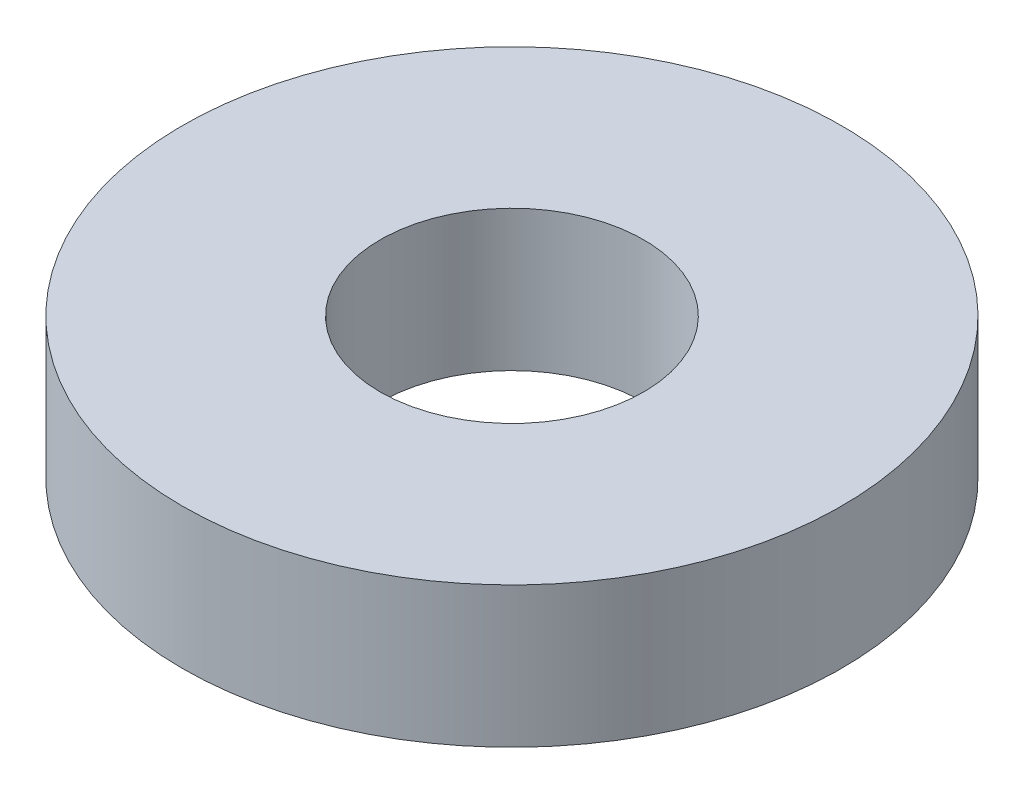
ISO-10303-21;
HEADER;
FILE_DESCRIPTION(('STEP AP214'),'2;1');
FILE_NAME('part.step','',(''),(''),'','','');
FILE_SCHEMA(('AUTOMOTIVE_DESIGN { 1 0 10303 214 1 1 1 1 }'));
ENDSEC;
DATA;
#1=APPLICATION_CONTEXT('core data for automotive mechanical design processes');
#2=APPLICATION_PROTOCOL_DEFINITION('international standard','automotive_design',2000,#1);
#3=PRODUCT_CONTEXT('',#1,'mechanical');
#4=PRODUCT('Part','Part','',(#3));
#5=PRODUCT_RELATED_PRODUCT_CATEGORY('part','',(#4));
#6=PRODUCT_DEFINITION_FORMATION('','',#4);
#7=PRODUCT_DEFINITION_CONTEXT('part definition',#1,'design');
#8=PRODUCT_DEFINITION('design','',#6,#7);
#9=PRODUCT_DEFINITION_SHAPE('','',#8);
#10=(LENGTH_UNIT() NAMED_UNIT(*) SI_UNIT(.MILLI.,.METRE.));
#11=(NAMED_UNIT(*) PLANE_ANGLE_UNIT() SI_UNIT($,.RADIAN.));
#12=(NAMED_UNIT(*) SI_UNIT($,.STERADIAN.) SOLID_ANGLE_UNIT());
#13=UNCERTAINTY_MEASURE_WITH_UNIT(LENGTH_MEASURE(1.E-05),#10,'distance_accuracy_value','');
#14=(GEOMETRIC_REPRESENTATION_CONTEXT(3) GLOBAL_UNCERTAINTY_ASSIGNED_CONTEXT((#13)) GLOBAL_UNIT_ASSIGNED_CONTEXT((#10,
#11,#12)) REPRESENTATION_CONTEXT('',''));
#15=CARTESIAN_POINT('',(0.,0.,0.));
#16=DIRECTION('',(0.,0.,1.));
#17=DIRECTION('',(1.,0.,0.));
#18=AXIS2_PLACEMENT_3D('',#15,#16,#17);
#19=CARTESIAN_POINT('',(0.,16.,0.));
#20=DIRECTION('',(0.,-1.,0.));
#21=DIRECTION('',(0.,0.,-1.));
#22=AXIS2_PLACEMENT_3D('',#19,#20,#21);
#23=CYLINDRICAL_SURFACE('',#22,37.5);
#24=CARTESIAN_POINT('',(0.,16.,0.));
#25=DIRECTION('',(0.,1.,0.));
#26=DIRECTION('',(0.,0.,1.));
#27=AXIS2_PLACEMENT_3D('',#24,#25,#26);
#28=CIRCLE('',#27,37.5);
#29=CARTESIAN_POINT('',(0.,16.,37.5));
#30=VERTEX_POINT('',#29);
#31=EDGE_CURVE('E10',#30,#30,#28,.T.);
#32=ORIENTED_EDGE('',*,*,#31,.F.);
#33=EDGE_LOOP('',(#32));
#34=FACE_BOUND('',#33,.T.);
#35=CARTESIAN_POINT('',(0.,0.,0.));
#36=DIRECTION('',(0.,1.,0.));
#37=DIRECTION('',(0.,0.,1.));
#38=AXIS2_PLACEMENT_3D('',#35,#36,#37);
#39=CIRCLE('',#38,37.5);
#40=CARTESIAN_POINT('',(0.,0.,37.5));
#41=VERTEX_POINT('',#40);
#42=EDGE_CURVE('E37',#41,#41,#39,.T.);
#43=ORIENTED_EDGE('',*,*,#42,.T.);
#44=EDGE_LOOP('',(#43));
#45=FACE_BOUND('',#44,.T.);
#46=ADVANCED_FACE('F40',(#34,#45),#23,.T.);
#47=CARTESIAN_POINT('',(0.,16.,0.));
#48=DIRECTION('',(0.,1.,0.));
#49=DIRECTION('',(0.,0.,1.));
#50=AXIS2_PLACEMENT_3D('',#47,#48,#49);
#51=PLANE('',#50);
#52=CARTESIAN_POINT('',(0.,16.,0.));
#53=DIRECTION('',(0.,1.,0.));
#54=DIRECTION('',(0.,0.,1.));
#55=AXIS2_PLACEMENT_3D('',#52,#53,#54);
#56=CIRCLE('',#55,15.);
#57=CARTESIAN_POINT('',(0.,16.,15.));
#58=VERTEX_POINT('',#57);
#59=EDGE_CURVE('E50',#58,#58,#56,.T.);
#60=ORIENTED_EDGE('',*,*,#59,.F.);
#61=EDGE_LOOP('',(#60));
#62=FACE_BOUND('',#61,.T.);
#63=ORIENTED_EDGE('',*,*,#31,.T.);
#64=EDGE_LOOP('',(#63));
#65=FACE_BOUND('',#64,.T.);
#66=ADVANCED_FACE('F59',(#62,#65),#51,.T.);
#67=CARTESIAN_POINT('',(0.,0.,0.));
#68=DIRECTION('',(0.,1.,0.));
#69=DIRECTION('',(0.,0.,1.));
#70=AXIS2_PLACEMENT_3D('',#67,#68,#69);
#71=PLANE('',#70);
#72=CARTESIAN_POINT('',(0.,0.,0.));
#73=DIRECTION('',(0.,1.,0.));
#74=DIRECTION('',(0.,0.,1.));
#75=AXIS2_PLACEMENT_3D('',#72,#73,#74);
#76=CIRCLE('',#75,15.);
#77=CARTESIAN_POINT('',(0.,0.,15.));
#78=VERTEX_POINT('',#77);
#79=EDGE_CURVE('E47',#78,#78,#76,.T.);
#80=ORIENTED_EDGE('',*,*,#79,.T.);
#81=EDGE_LOOP('',(#80));
#82=FACE_BOUND('',#81,.T.);
#83=ORIENTED_EDGE('',*,*,#42,.F.);
#84=EDGE_LOOP('',(#83));
#85=FACE_BOUND('',#84,.T.);
#86=ADVANCED_FACE('F58',(#82,#85),#71,.F.);
#87=CARTESIAN_POINT('',(0.,16.,0.));
#88=DIRECTION('',(0.,-1.,0.));
#89=DIRECTION('',(0.,0.,-1.));
#90=AXIS2_PLACEMENT_3D('',#87,#88,#89);
#91=CYLINDRICAL_SURFACE('',#90,15.);
#92=ORIENTED_EDGE('',*,*,#59,.T.);
#93=EDGE_LOOP('',(#92));
#94=FACE_BOUND('',#93,.T.);
#95=ORIENTED_EDGE('',*,*,#79,.F.);
#96=EDGE_LOOP('',(#95));
#97=FACE_BOUND('',#96,.T.);
#98=ADVANCED_FACE('F54',(#94,#97),#91,.F.);
#99=CLOSED_SHELL('',(#46,#66,#86,#98));
#100=MANIFOLD_SOLID_BREP('B2',#99);
#101=ADVANCED_BREP_SHAPE_REPRESENTATION('',(#18,#100),#14);
#102=SHAPE_DEFINITION_REPRESENTATION(#9,#101);
ENDSEC;
END-ISO-10303-21;
